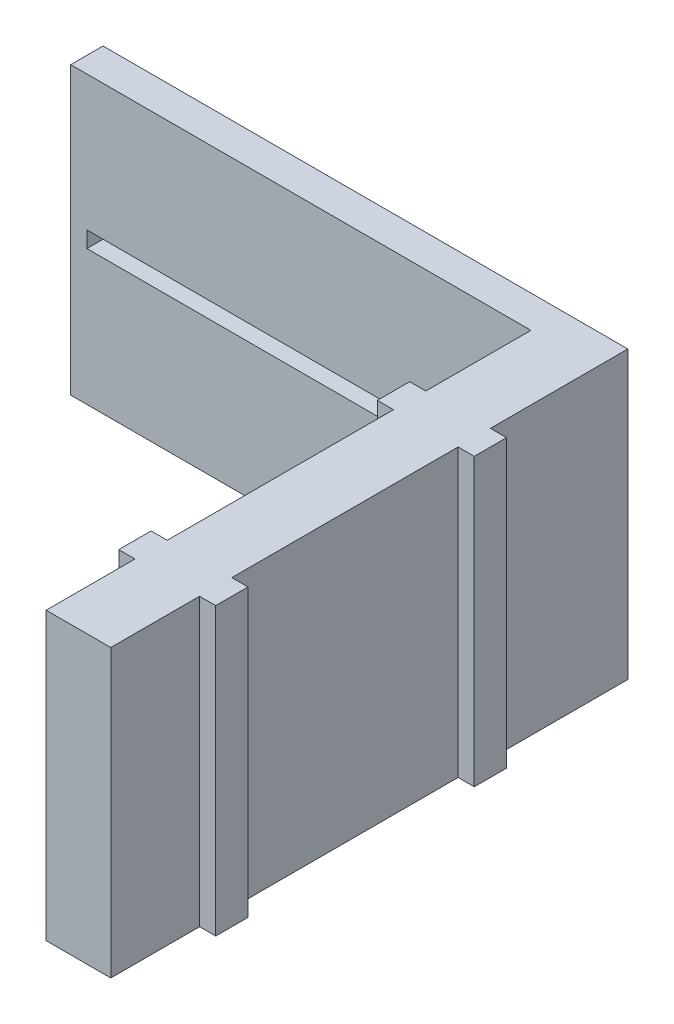
ISO-10303-21;
HEADER;
FILE_DESCRIPTION(('STEP AP214'),'2;1');
FILE_NAME('part.step','',(''),(''),'','','');
FILE_SCHEMA(('AUTOMOTIVE_DESIGN { 1 0 10303 214 1 1 1 1 }'));
ENDSEC;
DATA;
#1=APPLICATION_CONTEXT('core data for automotive mechanical design processes');
#2=APPLICATION_PROTOCOL_DEFINITION('international standard','automotive_design',2000,#1);
#3=PRODUCT_CONTEXT('',#1,'mechanical');
#4=PRODUCT('Part','Part','',(#3));
#5=PRODUCT_RELATED_PRODUCT_CATEGORY('part','',(#4));
#6=PRODUCT_DEFINITION_FORMATION('','',#4);
#7=PRODUCT_DEFINITION_CONTEXT('part definition',#1,'design');
#8=PRODUCT_DEFINITION('design','',#6,#7);
#9=PRODUCT_DEFINITION_SHAPE('','',#8);
#10=(LENGTH_UNIT() NAMED_UNIT(*) SI_UNIT(.MILLI.,.METRE.));
#11=(NAMED_UNIT(*) PLANE_ANGLE_UNIT() SI_UNIT($,.RADIAN.));
#12=(NAMED_UNIT(*) SI_UNIT($,.STERADIAN.) SOLID_ANGLE_UNIT());
#13=UNCERTAINTY_MEASURE_WITH_UNIT(LENGTH_MEASURE(1.E-05),#10,'distance_accuracy_value','');
#14=(GEOMETRIC_REPRESENTATION_CONTEXT(3) GLOBAL_UNCERTAINTY_ASSIGNED_CONTEXT((#13)) GLOBAL_UNIT_ASSIGNED_CONTEXT((#10,
#11,#12)) REPRESENTATION_CONTEXT('',''));
#15=CARTESIAN_POINT('',(0.,0.,0.));
#16=DIRECTION('',(0.,0.,1.));
#17=DIRECTION('',(1.,0.,0.));
#18=AXIS2_PLACEMENT_3D('',#15,#16,#17);
#19=CARTESIAN_POINT('',(-10.,0.,0.));
#20=DIRECTION('',(-1.,0.,0.));
#21=DIRECTION('',(0.,0.,-1.));
#22=AXIS2_PLACEMENT_3D('',#19,#20,#21);
#23=PLANE('',#22);
#24=DIRECTION('',(0.,0.,1.));
#25=VECTOR('',#24,1.);
#26=CARTESIAN_POINT('',(-10.,44.2846165618336,80.));
#27=LINE('',#26,#25);
#28=CARTESIAN_POINT('',(-10.,44.2846165618336,-27.47));
#29=VERTEX_POINT('',#28);
#30=CARTESIAN_POINT('',(-10.,44.2846165618336,42.53));
#31=VERTEX_POINT('',#30);
#32=EDGE_CURVE('E292',#29,#31,#27,.T.);
#33=ORIENTED_EDGE('',*,*,#32,.F.);
#34=DIRECTION('',(0.,1.,0.));
#35=VECTOR('',#34,1.);
#36=CARTESIAN_POINT('',(-10.,0.,-27.47));
#37=LINE('',#36,#35);
#38=CARTESIAN_POINT('',(-10.,-44.2846165618336,-27.47));
#39=VERTEX_POINT('',#38);
#40=EDGE_CURVE('E230',#39,#29,#37,.T.);
#41=ORIENTED_EDGE('',*,*,#40,.F.);
#42=DIRECTION('',(0.,0.,-1.));
#43=VECTOR('',#42,1.);
#44=CARTESIAN_POINT('',(-10.,-44.2846165618336,80.));
#45=LINE('',#44,#43);
#46=CARTESIAN_POINT('',(-10.,-44.2846165618336,42.53));
#47=VERTEX_POINT('',#46);
#48=EDGE_CURVE('E285',#47,#39,#45,.T.);
#49=ORIENTED_EDGE('',*,*,#48,.F.);
#50=DIRECTION('',(0.,1.,0.));
#51=VECTOR('',#50,1.);
#52=CARTESIAN_POINT('',(-10.,-44.2846165618336,42.53));
#53=LINE('',#52,#51);
#54=EDGE_CURVE('E56',#47,#31,#53,.T.);
#55=ORIENTED_EDGE('',*,*,#54,.T.);
#56=EDGE_LOOP('',(#33,#41,#49,#55));
#57=FACE_BOUND('',#56,.T.);
#58=ADVANCED_FACE('F41',(#57),#23,.T.);
#59=CARTESIAN_POINT('',(-10.,-44.2846165618336,-37.47));
#60=VERTEX_POINT('',#59);
#61=CARTESIAN_POINT('',(-10.,-44.2846165618336,-70.));
#62=VERTEX_POINT('',#61);
#63=EDGE_CURVE('E280',#60,#62,#45,.T.);
#64=ORIENTED_EDGE('',*,*,#63,.F.);
#65=DIRECTION('',(0.,-1.,0.));
#66=VECTOR('',#65,1.);
#67=CARTESIAN_POINT('',(-10.,0.,-37.47));
#68=LINE('',#67,#66);
#69=CARTESIAN_POINT('',(-10.,44.2846165618336,-37.47));
#70=VERTEX_POINT('',#69);
#71=EDGE_CURVE('E64',#70,#60,#68,.T.);
#72=ORIENTED_EDGE('',*,*,#71,.F.);
#73=CARTESIAN_POINT('',(-10.,44.2846165618336,-70.));
#74=VERTEX_POINT('',#73);
#75=EDGE_CURVE('E289',#74,#70,#27,.T.);
#76=ORIENTED_EDGE('',*,*,#75,.F.);
#77=DIRECTION('',(0.,1.,0.));
#78=VECTOR('',#77,1.);
#79=CARTESIAN_POINT('',(-10.,44.2846165618336,-70.));
#80=LINE('',#79,#78);
#81=CARTESIAN_POINT('',(-10.,2.49999999999999,-70.));
#82=VERTEX_POINT('',#81);
#83=EDGE_CURVE('E291',#82,#74,#80,.T.);
#84=ORIENTED_EDGE('',*,*,#83,.F.);
#85=DIRECTION('',(0.,0.,1.));
#86=VECTOR('',#85,1.);
#87=CARTESIAN_POINT('',(-10.,2.49999999999999,-80.));
#88=LINE('',#87,#86);
#89=CARTESIAN_POINT('',(-10.,2.50000000000001,-80.));
#90=VERTEX_POINT('',#89);
#91=EDGE_CURVE('E11',#90,#82,#88,.T.);
#92=ORIENTED_EDGE('',*,*,#91,.F.);
#93=DIRECTION('',(0.,1.,0.));
#94=VECTOR('',#93,1.);
#95=CARTESIAN_POINT('',(-10.,44.2846165618336,-80.));
#96=LINE('',#95,#94);
#97=CARTESIAN_POINT('',(-10.,-2.5,-80.));
#98=VERTEX_POINT('',#97);
#99=EDGE_CURVE('E232',#98,#90,#96,.T.);
#100=ORIENTED_EDGE('',*,*,#99,.F.);
#101=DIRECTION('',(0.,0.,-1.));
#102=VECTOR('',#101,1.);
#103=CARTESIAN_POINT('',(-10.,-2.50000000000001,-80.));
#104=LINE('',#103,#102);
#105=CARTESIAN_POINT('',(-10.,-2.50000000000001,-70.));
#106=VERTEX_POINT('',#105);
#107=EDGE_CURVE('E295',#106,#98,#104,.T.);
#108=ORIENTED_EDGE('',*,*,#107,.F.);
#109=EDGE_CURVE('E296',#62,#106,#80,.T.);
#110=ORIENTED_EDGE('',*,*,#109,.F.);
#111=EDGE_LOOP('',(#64,#72,#76,#84,#92,#100,#108,#110));
#112=FACE_BOUND('',#111,.T.);
#113=ADVANCED_FACE('F422',(#112),#23,.T.);
#114=CARTESIAN_POINT('',(10.,0.,0.));
#115=DIRECTION('',(1.,0.,0.));
#116=DIRECTION('',(0.,0.,-1.));
#117=AXIS2_PLACEMENT_3D('',#114,#115,#116);
#118=PLANE('',#117);
#119=DIRECTION('',(0.,0.,-1.));
#120=VECTOR('',#119,1.);
#121=CARTESIAN_POINT('',(10.,-44.2846165618336,80.));
#122=LINE('',#121,#120);
#123=CARTESIAN_POINT('',(10.,-44.2846165618336,42.53));
#124=VERTEX_POINT('',#123);
#125=CARTESIAN_POINT('',(10.,-44.2846165618336,-27.47));
#126=VERTEX_POINT('',#125);
#127=EDGE_CURVE('E399',#124,#126,#122,.T.);
#128=ORIENTED_EDGE('',*,*,#127,.T.);
#129=DIRECTION('',(0.,1.,0.));
#130=VECTOR('',#129,1.);
#131=CARTESIAN_POINT('',(10.,0.,-27.47));
#132=LINE('',#131,#130);
#133=CARTESIAN_POINT('',(10.,44.2846165618336,-27.47));
#134=VERTEX_POINT('',#133);
#135=EDGE_CURVE('E311',#126,#134,#132,.T.);
#136=ORIENTED_EDGE('',*,*,#135,.T.);
#137=DIRECTION('',(0.,0.,1.));
#138=VECTOR('',#137,1.);
#139=CARTESIAN_POINT('',(10.,44.2846165618336,80.));
#140=LINE('',#139,#138);
#141=CARTESIAN_POINT('',(10.,44.2846165618336,42.53));
#142=VERTEX_POINT('',#141);
#143=EDGE_CURVE('E393',#134,#142,#140,.T.);
#144=ORIENTED_EDGE('',*,*,#143,.T.);
#145=DIRECTION('',(0.,1.,0.));
#146=VECTOR('',#145,1.);
#147=CARTESIAN_POINT('',(10.,-44.2846165618336,42.53));
#148=LINE('',#147,#146);
#149=EDGE_CURVE('E338',#124,#142,#148,.T.);
#150=ORIENTED_EDGE('',*,*,#149,.F.);
#151=EDGE_LOOP('',(#128,#136,#144,#150));
#152=FACE_BOUND('',#151,.T.);
#153=ADVANCED_FACE('F464',(#152),#118,.T.);
#154=CARTESIAN_POINT('',(10.,44.2846165618336,-80.));
#155=VERTEX_POINT('',#154);
#156=CARTESIAN_POINT('',(10.,44.2846165618336,-37.47));
#157=VERTEX_POINT('',#156);
#158=EDGE_CURVE('E389',#155,#157,#140,.T.);
#159=ORIENTED_EDGE('',*,*,#158,.T.);
#160=DIRECTION('',(0.,-1.,0.));
#161=VECTOR('',#160,1.);
#162=CARTESIAN_POINT('',(10.,0.,-37.47));
#163=LINE('',#162,#161);
#164=CARTESIAN_POINT('',(10.,-44.2846165618336,-37.47));
#165=VERTEX_POINT('',#164);
#166=EDGE_CURVE('E303',#157,#165,#163,.T.);
#167=ORIENTED_EDGE('',*,*,#166,.T.);
#168=CARTESIAN_POINT('',(10.,-44.2846165618336,-80.));
#169=VERTEX_POINT('',#168);
#170=EDGE_CURVE('E395',#165,#169,#122,.T.);
#171=ORIENTED_EDGE('',*,*,#170,.T.);
#172=DIRECTION('',(0.,1.,0.));
#173=VECTOR('',#172,1.);
#174=CARTESIAN_POINT('',(10.,44.2846165618336,-80.));
#175=LINE('',#174,#173);
#176=EDGE_CURVE('E385',#169,#155,#175,.T.);
#177=ORIENTED_EDGE('',*,*,#176,.T.);
#178=EDGE_LOOP('',(#159,#167,#171,#177));
#179=FACE_BOUND('',#178,.T.);
#180=ADVANCED_FACE('F508',(#179),#118,.T.);
#181=CARTESIAN_POINT('',(10.,44.2846165618336,-80.));
#182=DIRECTION('',(0.,0.,1.));
#183=DIRECTION('',(1.,0.,0.));
#184=AXIS2_PLACEMENT_3D('',#181,#182,#183);
#185=PLANE('',#184);
#186=ORIENTED_EDGE('',*,*,#99,.T.);
#187=DIRECTION('',(-1.,0.,0.));
#188=VECTOR('',#187,1.);
#189=CARTESIAN_POINT('',(0.,2.49999999999999,-80.));
#190=LINE('',#189,#188);
#191=CARTESIAN_POINT('',(-147.4,2.49999999999999,-80.));
#192=VERTEX_POINT('',#191);
#193=EDGE_CURVE('E368',#90,#192,#190,.T.);
#194=ORIENTED_EDGE('',*,*,#193,.T.);
#195=DIRECTION('',(0.,1.,0.));
#196=VECTOR('',#195,1.);
#197=CARTESIAN_POINT('',(-147.4,-2.50000000000001,-80.));
#198=LINE('',#197,#196);
#199=CARTESIAN_POINT('',(-147.4,-2.50000000000001,-80.));
#200=VERTEX_POINT('',#199);
#201=EDGE_CURVE('E324',#200,#192,#198,.T.);
#202=ORIENTED_EDGE('',*,*,#201,.F.);
#203=DIRECTION('',(-1.,0.,0.));
#204=VECTOR('',#203,1.);
#205=CARTESIAN_POINT('',(0.,-2.50000000000001,-80.));
#206=LINE('',#205,#204);
#207=EDGE_CURVE('E366',#98,#200,#206,.T.);
#208=ORIENTED_EDGE('',*,*,#207,.F.);
#209=EDGE_LOOP('',(#186,#194,#202,#208));
#210=FACE_BOUND('',#209,.T.);
#211=DIRECTION('',(0.,-1.,0.));
#212=VECTOR('',#211,1.);
#213=CARTESIAN_POINT('',(-152.4,-44.2846165618336,-80.));
#214=LINE('',#213,#212);
#215=CARTESIAN_POINT('',(-152.4,44.2846165618336,-80.));
#216=VERTEX_POINT('',#215);
#217=CARTESIAN_POINT('',(-152.4,-44.2846165618336,-80.));
#218=VERTEX_POINT('',#217);
#219=EDGE_CURVE('E373',#216,#218,#214,.T.);
#220=ORIENTED_EDGE('',*,*,#219,.F.);
#221=DIRECTION('',(-1.,0.,0.));
#222=VECTOR('',#221,1.);
#223=CARTESIAN_POINT('',(10.,44.2846165618336,-80.));
#224=LINE('',#223,#222);
#225=EDGE_CURVE('E49',#155,#216,#224,.T.);
#226=ORIENTED_EDGE('',*,*,#225,.F.);
#227=ORIENTED_EDGE('',*,*,#176,.F.);
#228=DIRECTION('',(-1.,0.,0.));
#229=VECTOR('',#228,1.);
#230=CARTESIAN_POINT('',(10.,-44.2846165618336,-80.));
#231=LINE('',#230,#229);
#232=EDGE_CURVE('E398',#169,#218,#231,.T.);
#233=ORIENTED_EDGE('',*,*,#232,.T.);
#234=EDGE_LOOP('',(#220,#226,#227,#233));
#235=FACE_BOUND('',#234,.T.);
#236=ADVANCED_FACE('F43',(#210,#235),#185,.F.);
#237=CARTESIAN_POINT('',(10.,44.2846165618336,80.));
#238=DIRECTION('',(0.,-1.,0.));
#239=DIRECTION('',(0.,0.,-1.));
#240=AXIS2_PLACEMENT_3D('',#237,#238,#239);
#241=PLANE('',#240);
#242=DIRECTION('',(1.,0.,0.));
#243=VECTOR('',#242,1.);
#244=CARTESIAN_POINT('',(-152.4,44.2846165618336,-70.));
#245=LINE('',#244,#243);
#246=CARTESIAN_POINT('',(-152.4,44.2846165618336,-70.));
#247=VERTEX_POINT('',#246);
#248=EDGE_CURVE('E380',#247,#74,#245,.T.);
#249=ORIENTED_EDGE('',*,*,#248,.T.);
#250=ORIENTED_EDGE('',*,*,#75,.T.);
#251=DIRECTION('',(1.,0.,0.));
#252=VECTOR('',#251,1.);
#253=CARTESIAN_POINT('',(-15.,44.2846165618336,-37.47));
#254=LINE('',#253,#252);
#255=CARTESIAN_POINT('',(-15.,44.2846165618336,-37.47));
#256=VERTEX_POINT('',#255);
#257=EDGE_CURVE('E233',#256,#70,#254,.T.);
#258=ORIENTED_EDGE('',*,*,#257,.F.);
#259=DIRECTION('',(0.,0.,1.));
#260=VECTOR('',#259,1.);
#261=CARTESIAN_POINT('',(-15.,44.2846165618336,0.));
#262=LINE('',#261,#260);
#263=CARTESIAN_POINT('',(-15.,44.2846165618336,-27.47));
#264=VERTEX_POINT('',#263);
#265=EDGE_CURVE('E221',#256,#264,#262,.T.);
#266=ORIENTED_EDGE('',*,*,#265,.T.);
#267=DIRECTION('',(1.,0.,0.));
#268=VECTOR('',#267,1.);
#269=CARTESIAN_POINT('',(-15.,44.2846165618336,-27.47));
#270=LINE('',#269,#268);
#271=EDGE_CURVE('E227',#264,#29,#270,.T.);
#272=ORIENTED_EDGE('',*,*,#271,.T.);
#273=ORIENTED_EDGE('',*,*,#32,.T.);
#274=DIRECTION('',(1.,0.,0.));
#275=VECTOR('',#274,1.);
#276=CARTESIAN_POINT('',(-15.,44.2846165618336,42.53));
#277=LINE('',#276,#275);
#278=CARTESIAN_POINT('',(-15.,44.2846165618336,42.53));
#279=VERTEX_POINT('',#278);
#280=EDGE_CURVE('E246',#279,#31,#277,.T.);
#281=ORIENTED_EDGE('',*,*,#280,.F.);
#282=DIRECTION('',(0.,0.,1.));
#283=VECTOR('',#282,1.);
#284=CARTESIAN_POINT('',(-15.,44.2846165618336,42.53));
#285=LINE('',#284,#283);
#286=CARTESIAN_POINT('',(-15.,44.2846165618336,52.53));
#287=VERTEX_POINT('',#286);
#288=EDGE_CURVE('E252',#279,#287,#285,.T.);
#289=ORIENTED_EDGE('',*,*,#288,.T.);
#290=DIRECTION('',(1.,0.,0.));
#291=VECTOR('',#290,1.);
#292=CARTESIAN_POINT('',(-15.,44.2846165618336,52.53));
#293=LINE('',#292,#291);
#294=CARTESIAN_POINT('',(-10.,44.2846165618336,52.53));
#295=VERTEX_POINT('',#294);
#296=EDGE_CURVE('E265',#287,#295,#293,.T.);
#297=ORIENTED_EDGE('',*,*,#296,.T.);
#298=CARTESIAN_POINT('',(-10.,44.2846165618336,80.));
#299=VERTEX_POINT('',#298);
#300=EDGE_CURVE('E288',#295,#299,#27,.T.);
#301=ORIENTED_EDGE('',*,*,#300,.T.);
#302=DIRECTION('',(-1.,0.,0.));
#303=VECTOR('',#302,1.);
#304=CARTESIAN_POINT('',(10.,44.2846165618336,80.));
#305=LINE('',#304,#303);
#306=CARTESIAN_POINT('',(10.,44.2846165618336,80.));
#307=VERTEX_POINT('',#306);
#308=EDGE_CURVE('E403',#307,#299,#305,.T.);
#309=ORIENTED_EDGE('',*,*,#308,.F.);
#310=CARTESIAN_POINT('',(10.,44.2846165618336,52.53));
#311=VERTEX_POINT('',#310);
#312=EDGE_CURVE('E388',#311,#307,#140,.T.);
#313=ORIENTED_EDGE('',*,*,#312,.F.);
#314=DIRECTION('',(-1.,0.,0.));
#315=VECTOR('',#314,1.);
#316=CARTESIAN_POINT('',(15.,44.2846165618336,52.53));
#317=LINE('',#316,#315);
#318=CARTESIAN_POINT('',(15.,44.2846165618336,52.53));
#319=VERTEX_POINT('',#318);
#320=EDGE_CURVE('E325',#319,#311,#317,.T.);
#321=ORIENTED_EDGE('',*,*,#320,.F.);
#322=DIRECTION('',(0.,0.,1.));
#323=VECTOR('',#322,1.);
#324=CARTESIAN_POINT('',(15.,44.2846165618336,42.53));
#325=LINE('',#324,#323);
#326=CARTESIAN_POINT('',(15.,44.2846165618336,42.53));
#327=VERTEX_POINT('',#326);
#328=EDGE_CURVE('E341',#327,#319,#325,.T.);
#329=ORIENTED_EDGE('',*,*,#328,.F.);
#330=DIRECTION('',(-1.,0.,0.));
#331=VECTOR('',#330,1.);
#332=CARTESIAN_POINT('',(15.,44.2846165618336,42.53));
#333=LINE('',#332,#331);
#334=EDGE_CURVE('E334',#327,#142,#333,.T.);
#335=ORIENTED_EDGE('',*,*,#334,.T.);
#336=ORIENTED_EDGE('',*,*,#143,.F.);
#337=DIRECTION('',(-1.,0.,0.));
#338=VECTOR('',#337,1.);
#339=CARTESIAN_POINT('',(15.,44.2846165618336,-27.47));
#340=LINE('',#339,#338);
#341=CARTESIAN_POINT('',(15.,44.2846165618336,-27.47));
#342=VERTEX_POINT('',#341);
#343=EDGE_CURVE('E310',#342,#134,#340,.T.);
#344=ORIENTED_EDGE('',*,*,#343,.F.);
#345=DIRECTION('',(0.,0.,1.));
#346=VECTOR('',#345,1.);
#347=CARTESIAN_POINT('',(15.,44.2846165618336,0.));
#348=LINE('',#347,#346);
#349=CARTESIAN_POINT('',(15.,44.2846165618336,-37.47));
#350=VERTEX_POINT('',#349);
#351=EDGE_CURVE('E308',#350,#342,#348,.T.);
#352=ORIENTED_EDGE('',*,*,#351,.F.);
#353=DIRECTION('',(-1.,0.,0.));
#354=VECTOR('',#353,1.);
#355=CARTESIAN_POINT('',(15.,44.2846165618336,-37.47));
#356=LINE('',#355,#354);
#357=EDGE_CURVE('E318',#350,#157,#356,.T.);
#358=ORIENTED_EDGE('',*,*,#357,.T.);
#359=ORIENTED_EDGE('',*,*,#158,.F.);
#360=ORIENTED_EDGE('',*,*,#225,.T.);
#361=DIRECTION('',(0.,0.,-1.));
#362=VECTOR('',#361,1.);
#363=CARTESIAN_POINT('',(-152.4,44.2846165618336,-80.));
#364=LINE('',#363,#362);
#365=EDGE_CURVE('E365',#247,#216,#364,.T.);
#366=ORIENTED_EDGE('',*,*,#365,.F.);
#367=EDGE_LOOP('',(#249,#250,#258,#266,#272,#273,#281,#289,#297,#301,#309,#313,#321,#329,#335,
#336,#344,#352,#358,#359,#360,#366));
#368=FACE_BOUND('',#367,.T.);
#369=ADVANCED_FACE('F236',(#368),#241,.F.);
#370=CARTESIAN_POINT('',(10.,44.2846165618336,80.));
#371=DIRECTION('',(0.,0.,-1.));
#372=DIRECTION('',(0.,1.,0.));
#373=AXIS2_PLACEMENT_3D('',#370,#371,#372);
#374=PLANE('',#373);
#375=ORIENTED_EDGE('',*,*,#308,.T.);
#376=DIRECTION('',(0.,-1.,0.));
#377=VECTOR('',#376,1.);
#378=CARTESIAN_POINT('',(-10.,44.2846165618336,80.));
#379=LINE('',#378,#377);
#380=CARTESIAN_POINT('',(-10.,-44.2846165618336,80.));
#381=VERTEX_POINT('',#380);
#382=EDGE_CURVE('E284',#299,#381,#379,.T.);
#383=ORIENTED_EDGE('',*,*,#382,.T.);
#384=DIRECTION('',(-1.,0.,0.));
#385=VECTOR('',#384,1.);
#386=CARTESIAN_POINT('',(10.,-44.2846165618336,80.));
#387=LINE('',#386,#385);
#388=CARTESIAN_POINT('',(10.,-44.2846165618336,80.));
#389=VERTEX_POINT('',#388);
#390=EDGE_CURVE('E401',#389,#381,#387,.T.);
#391=ORIENTED_EDGE('',*,*,#390,.F.);
#392=DIRECTION('',(0.,-1.,0.));
#393=VECTOR('',#392,1.);
#394=CARTESIAN_POINT('',(10.,44.2846165618336,80.));
#395=LINE('',#394,#393);
#396=EDGE_CURVE('E392',#307,#389,#395,.T.);
#397=ORIENTED_EDGE('',*,*,#396,.F.);
#398=EDGE_LOOP('',(#375,#383,#391,#397));
#399=FACE_BOUND('',#398,.T.);
#400=ADVANCED_FACE('F435',(#399),#374,.F.);
#401=CARTESIAN_POINT('',(10.,-44.2846165618336,80.));
#402=DIRECTION('',(0.,1.,0.));
#403=DIRECTION('',(0.,0.,1.));
#404=AXIS2_PLACEMENT_3D('',#401,#402,#403);
#405=PLANE('',#404);
#406=DIRECTION('',(0.,0.,1.));
#407=VECTOR('',#406,1.);
#408=CARTESIAN_POINT('',(-152.4,-44.2846165618336,-70.));
#409=LINE('',#408,#407);
#410=CARTESIAN_POINT('',(-152.4,-44.2846165618336,-70.));
#411=VERTEX_POINT('',#410);
#412=EDGE_CURVE('E376',#218,#411,#409,.T.);
#413=ORIENTED_EDGE('',*,*,#412,.F.);
#414=ORIENTED_EDGE('',*,*,#232,.F.);
#415=ORIENTED_EDGE('',*,*,#170,.F.);
#416=DIRECTION('',(-1.,0.,0.));
#417=VECTOR('',#416,1.);
#418=CARTESIAN_POINT('',(15.,-44.2846165618336,-37.47));
#419=LINE('',#418,#417);
#420=CARTESIAN_POINT('',(15.,-44.2846165618336,-37.47));
#421=VERTEX_POINT('',#420);
#422=EDGE_CURVE('E320',#421,#165,#419,.T.);
#423=ORIENTED_EDGE('',*,*,#422,.F.);
#424=DIRECTION('',(0.,0.,-1.));
#425=VECTOR('',#424,1.);
#426=CARTESIAN_POINT('',(15.,-44.2846165618336,0.));
#427=LINE('',#426,#425);
#428=CARTESIAN_POINT('',(15.,-44.2846165618336,-27.47));
#429=VERTEX_POINT('',#428);
#430=EDGE_CURVE('E302',#429,#421,#427,.T.);
#431=ORIENTED_EDGE('',*,*,#430,.F.);
#432=DIRECTION('',(-1.,0.,0.));
#433=VECTOR('',#432,1.);
#434=CARTESIAN_POINT('',(15.,-44.2846165618336,-27.47));
#435=LINE('',#434,#433);
#436=EDGE_CURVE('E322',#429,#126,#435,.T.);
#437=ORIENTED_EDGE('',*,*,#436,.T.);
#438=ORIENTED_EDGE('',*,*,#127,.F.);
#439=DIRECTION('',(-1.,0.,0.));
#440=VECTOR('',#439,1.);
#441=CARTESIAN_POINT('',(15.,-44.2846165618336,42.53));
#442=LINE('',#441,#440);
#443=CARTESIAN_POINT('',(15.,-44.2846165618336,42.53));
#444=VERTEX_POINT('',#443);
#445=EDGE_CURVE('E331',#444,#124,#442,.T.);
#446=ORIENTED_EDGE('',*,*,#445,.F.);
#447=DIRECTION('',(0.,0.,-1.));
#448=VECTOR('',#447,1.);
#449=CARTESIAN_POINT('',(15.,-44.2846165618336,52.53));
#450=LINE('',#449,#448);
#451=CARTESIAN_POINT('',(15.,-44.2846165618336,52.53));
#452=VERTEX_POINT('',#451);
#453=EDGE_CURVE('E345',#452,#444,#450,.T.);
#454=ORIENTED_EDGE('',*,*,#453,.F.);
#455=DIRECTION('',(-1.,0.,0.));
#456=VECTOR('',#455,1.);
#457=CARTESIAN_POINT('',(15.,-44.2846165618336,52.53));
#458=LINE('',#457,#456);
#459=CARTESIAN_POINT('',(10.,-44.2846165618336,52.53));
#460=VERTEX_POINT('',#459);
#461=EDGE_CURVE('E328',#452,#460,#458,.T.);
#462=ORIENTED_EDGE('',*,*,#461,.T.);
#463=EDGE_CURVE('E396',#389,#460,#122,.T.);
#464=ORIENTED_EDGE('',*,*,#463,.F.);
#465=ORIENTED_EDGE('',*,*,#390,.T.);
#466=CARTESIAN_POINT('',(-10.,-44.2846165618336,52.53));
#467=VERTEX_POINT('',#466);
#468=EDGE_CURVE('E281',#381,#467,#45,.T.);
#469=ORIENTED_EDGE('',*,*,#468,.T.);
#470=DIRECTION('',(1.,0.,0.));
#471=VECTOR('',#470,1.);
#472=CARTESIAN_POINT('',(-15.,-44.2846165618336,52.53));
#473=LINE('',#472,#471);
#474=CARTESIAN_POINT('',(-15.,-44.2846165618336,52.53));
#475=VERTEX_POINT('',#474);
#476=EDGE_CURVE('E270',#475,#467,#473,.T.);
#477=ORIENTED_EDGE('',*,*,#476,.F.);
#478=DIRECTION('',(0.,0.,-1.));
#479=VECTOR('',#478,1.);
#480=CARTESIAN_POINT('',(-15.,-44.2846165618336,52.53));
#481=LINE('',#480,#479);
#482=CARTESIAN_POINT('',(-15.,-44.2846165618336,42.53));
#483=VERTEX_POINT('',#482);
#484=EDGE_CURVE('E259',#475,#483,#481,.T.);
#485=ORIENTED_EDGE('',*,*,#484,.T.);
#486=DIRECTION('',(1.,0.,0.));
#487=VECTOR('',#486,1.);
#488=CARTESIAN_POINT('',(-15.,-44.2846165618336,42.53));
#489=LINE('',#488,#487);
#490=EDGE_CURVE('E273',#483,#47,#489,.T.);
#491=ORIENTED_EDGE('',*,*,#490,.T.);
#492=ORIENTED_EDGE('',*,*,#48,.T.);
#493=DIRECTION('',(1.,0.,0.));
#494=VECTOR('',#493,1.);
#495=CARTESIAN_POINT('',(-15.,-44.2846165618336,-27.47));
#496=LINE('',#495,#494);
#497=CARTESIAN_POINT('',(-15.,-44.2846165618336,-27.47));
#498=VERTEX_POINT('',#497);
#499=EDGE_CURVE('E244',#498,#39,#496,.T.);
#500=ORIENTED_EDGE('',*,*,#499,.F.);
#501=DIRECTION('',(0.,0.,-1.));
#502=VECTOR('',#501,1.);
#503=CARTESIAN_POINT('',(-15.,-44.2846165618336,0.));
#504=LINE('',#503,#502);
#505=CARTESIAN_POINT('',(-15.,-44.2846165618336,-37.47));
#506=VERTEX_POINT('',#505);
#507=EDGE_CURVE('E223',#498,#506,#504,.T.);
#508=ORIENTED_EDGE('',*,*,#507,.T.);
#509=DIRECTION('',(1.,0.,0.));
#510=VECTOR('',#509,1.);
#511=CARTESIAN_POINT('',(-15.,-44.2846165618336,-37.47));
#512=LINE('',#511,#510);
#513=EDGE_CURVE('E249',#506,#60,#512,.T.);
#514=ORIENTED_EDGE('',*,*,#513,.T.);
#515=ORIENTED_EDGE('',*,*,#63,.T.);
#516=DIRECTION('',(1.,0.,0.));
#517=VECTOR('',#516,1.);
#518=CARTESIAN_POINT('',(-152.4,-44.2846165618336,-70.));
#519=LINE('',#518,#517);
#520=EDGE_CURVE('E382',#411,#62,#519,.T.);
#521=ORIENTED_EDGE('',*,*,#520,.F.);
#522=EDGE_LOOP('',(#413,#414,#415,#423,#431,#437,#438,#446,#454,#462,#464,#465,#469,#477,#485,
#491,#492,#500,#508,#514,#515,#521));
#523=FACE_BOUND('',#522,.T.);
#524=ADVANCED_FACE('F427',(#523),#405,.F.);
#525=DIRECTION('',(0.,-1.,0.));
#526=VECTOR('',#525,1.);
#527=CARTESIAN_POINT('',(10.,44.2846165618336,52.53));
#528=LINE('',#527,#526);
#529=EDGE_CURVE('E314',#311,#460,#528,.T.);
#530=ORIENTED_EDGE('',*,*,#529,.F.);
#531=ORIENTED_EDGE('',*,*,#312,.T.);
#532=ORIENTED_EDGE('',*,*,#396,.T.);
#533=ORIENTED_EDGE('',*,*,#463,.T.);
#534=EDGE_LOOP('',(#530,#531,#532,#533));
#535=FACE_BOUND('',#534,.T.);
#536=ADVANCED_FACE('F504',(#535),#118,.T.);
#537=CARTESIAN_POINT('',(-152.4,44.2846165618336,-70.));
#538=DIRECTION('',(0.,0.,-1.));
#539=DIRECTION('',(-1.,0.,0.));
#540=AXIS2_PLACEMENT_3D('',#537,#538,#539);
#541=PLANE('',#540);
#542=ORIENTED_EDGE('',*,*,#520,.T.);
#543=ORIENTED_EDGE('',*,*,#109,.T.);
#544=DIRECTION('',(-1.,0.,0.));
#545=VECTOR('',#544,1.);
#546=CARTESIAN_POINT('',(0.,-2.50000000000001,-70.));
#547=LINE('',#546,#545);
#548=CARTESIAN_POINT('',(-147.4,-2.50000000000001,-70.));
#549=VERTEX_POINT('',#548);
#550=EDGE_CURVE('E363',#106,#549,#547,.T.);
#551=ORIENTED_EDGE('',*,*,#550,.T.);
#552=DIRECTION('',(0.,1.,0.));
#553=VECTOR('',#552,1.);
#554=CARTESIAN_POINT('',(-147.4,-2.50000000000001,-70.));
#555=LINE('',#554,#553);
#556=CARTESIAN_POINT('',(-147.4,2.49999999999999,-70.));
#557=VERTEX_POINT('',#556);
#558=EDGE_CURVE('E356',#549,#557,#555,.T.);
#559=ORIENTED_EDGE('',*,*,#558,.T.);
#560=DIRECTION('',(-1.,0.,0.));
#561=VECTOR('',#560,1.);
#562=CARTESIAN_POINT('',(0.,2.49999999999999,-70.));
#563=LINE('',#562,#561);
#564=EDGE_CURVE('E362',#82,#557,#563,.T.);
#565=ORIENTED_EDGE('',*,*,#564,.F.);
#566=ORIENTED_EDGE('',*,*,#83,.T.);
#567=ORIENTED_EDGE('',*,*,#248,.F.);
#568=DIRECTION('',(0.,1.,0.));
#569=VECTOR('',#568,1.);
#570=CARTESIAN_POINT('',(-152.4,44.2846165618336,-70.));
#571=LINE('',#570,#569);
#572=EDGE_CURVE('E378',#411,#247,#571,.T.);
#573=ORIENTED_EDGE('',*,*,#572,.F.);
#574=EDGE_LOOP('',(#542,#543,#551,#559,#565,#566,#567,#573));
#575=FACE_BOUND('',#574,.T.);
#576=ADVANCED_FACE('F418',(#575),#541,.F.);
#577=CARTESIAN_POINT('',(-152.4,0.,0.));
#578=DIRECTION('',(1.,0.,0.));
#579=DIRECTION('',(0.,0.,-1.));
#580=AXIS2_PLACEMENT_3D('',#577,#578,#579);
#581=PLANE('',#580);
#582=ORIENTED_EDGE('',*,*,#219,.T.);
#583=ORIENTED_EDGE('',*,*,#412,.T.);
#584=ORIENTED_EDGE('',*,*,#572,.T.);
#585=ORIENTED_EDGE('',*,*,#365,.T.);
#586=EDGE_LOOP('',(#582,#583,#584,#585));
#587=FACE_BOUND('',#586,.T.);
#588=ADVANCED_FACE('F413',(#587),#581,.F.);
#589=CARTESIAN_POINT('',(0.,-2.50000000000001,-80.));
#590=DIRECTION('',(0.,-1.,0.));
#591=DIRECTION('',(0.,0.,-1.));
#592=AXIS2_PLACEMENT_3D('',#589,#590,#591);
#593=PLANE('',#592);
#594=ORIENTED_EDGE('',*,*,#550,.F.);
#595=ORIENTED_EDGE('',*,*,#107,.T.);
#596=ORIENTED_EDGE('',*,*,#207,.T.);
#597=DIRECTION('',(0.,0.,1.));
#598=VECTOR('',#597,1.);
#599=CARTESIAN_POINT('',(-147.4,-2.50000000000001,-80.));
#600=LINE('',#599,#598);
#601=EDGE_CURVE('E359',#200,#549,#600,.T.);
#602=ORIENTED_EDGE('',*,*,#601,.T.);
#603=EDGE_LOOP('',(#594,#595,#596,#602));
#604=FACE_BOUND('',#603,.T.);
#605=ADVANCED_FACE('F493',(#604),#593,.F.);
#606=CARTESIAN_POINT('',(0.,2.49999999999999,-80.));
#607=DIRECTION('',(0.,1.,0.));
#608=DIRECTION('',(0.,0.,1.));
#609=AXIS2_PLACEMENT_3D('',#606,#607,#608);
#610=PLANE('',#609);
#611=ORIENTED_EDGE('',*,*,#193,.F.);
#612=ORIENTED_EDGE('',*,*,#91,.T.);
#613=ORIENTED_EDGE('',*,*,#564,.T.);
#614=DIRECTION('',(0.,0.,1.));
#615=VECTOR('',#614,1.);
#616=CARTESIAN_POINT('',(-147.4,2.49999999999999,-80.));
#617=LINE('',#616,#615);
#618=EDGE_CURVE('E353',#192,#557,#617,.T.);
#619=ORIENTED_EDGE('',*,*,#618,.F.);
#620=EDGE_LOOP('',(#611,#612,#613,#619));
#621=FACE_BOUND('',#620,.T.);
#622=ADVANCED_FACE('F491',(#621),#610,.F.);
#623=CARTESIAN_POINT('',(-147.4,0.,0.));
#624=DIRECTION('',(1.,0.,0.));
#625=DIRECTION('',(0.,0.,-1.));
#626=AXIS2_PLACEMENT_3D('',#623,#624,#625);
#627=PLANE('',#626);
#628=ORIENTED_EDGE('',*,*,#201,.T.);
#629=ORIENTED_EDGE('',*,*,#618,.T.);
#630=ORIENTED_EDGE('',*,*,#558,.F.);
#631=ORIENTED_EDGE('',*,*,#601,.F.);
#632=EDGE_LOOP('',(#628,#629,#630,#631));
#633=FACE_BOUND('',#632,.T.);
#634=ADVANCED_FACE('F481',(#633),#627,.T.);
#635=CARTESIAN_POINT('',(15.,44.2846165618336,52.53));
#636=DIRECTION('',(0.,0.,-1.));
#637=DIRECTION('',(-1.,0.,0.));
#638=AXIS2_PLACEMENT_3D('',#635,#636,#637);
#639=PLANE('',#638);
#640=ORIENTED_EDGE('',*,*,#529,.T.);
#641=ORIENTED_EDGE('',*,*,#461,.F.);
#642=DIRECTION('',(0.,-1.,0.));
#643=VECTOR('',#642,1.);
#644=CARTESIAN_POINT('',(15.,44.2846165618336,52.53));
#645=LINE('',#644,#643);
#646=EDGE_CURVE('E347',#319,#452,#645,.T.);
#647=ORIENTED_EDGE('',*,*,#646,.F.);
#648=ORIENTED_EDGE('',*,*,#320,.T.);
#649=EDGE_LOOP('',(#640,#641,#647,#648));
#650=FACE_BOUND('',#649,.T.);
#651=ADVANCED_FACE('F477',(#650),#639,.F.);
#652=CARTESIAN_POINT('',(15.,-44.2846165618336,42.53));
#653=DIRECTION('',(0.,0.,1.));
#654=DIRECTION('',(1.,0.,0.));
#655=AXIS2_PLACEMENT_3D('',#652,#653,#654);
#656=PLANE('',#655);
#657=ORIENTED_EDGE('',*,*,#149,.T.);
#658=ORIENTED_EDGE('',*,*,#334,.F.);
#659=DIRECTION('',(0.,1.,0.));
#660=VECTOR('',#659,1.);
#661=CARTESIAN_POINT('',(15.,-44.2846165618336,42.53));
#662=LINE('',#661,#660);
#663=EDGE_CURVE('E337',#444,#327,#662,.T.);
#664=ORIENTED_EDGE('',*,*,#663,.F.);
#665=ORIENTED_EDGE('',*,*,#445,.T.);
#666=EDGE_LOOP('',(#657,#658,#664,#665));
#667=FACE_BOUND('',#666,.T.);
#668=ADVANCED_FACE('F480',(#667),#656,.F.);
#669=CARTESIAN_POINT('',(15.,0.,0.));
#670=DIRECTION('',(1.,0.,0.));
#671=DIRECTION('',(0.,0.,-1.));
#672=AXIS2_PLACEMENT_3D('',#669,#670,#671);
#673=PLANE('',#672);
#674=ORIENTED_EDGE('',*,*,#328,.T.);
#675=ORIENTED_EDGE('',*,*,#646,.T.);
#676=ORIENTED_EDGE('',*,*,#453,.T.);
#677=ORIENTED_EDGE('',*,*,#663,.T.);
#678=EDGE_LOOP('',(#674,#675,#676,#677));
#679=FACE_BOUND('',#678,.T.);
#680=ADVANCED_FACE('F475',(#679),#673,.T.);
#681=CARTESIAN_POINT('',(15.,0.,-27.47));
#682=DIRECTION('',(0.,0.,1.));
#683=DIRECTION('',(1.,0.,0.));
#684=AXIS2_PLACEMENT_3D('',#681,#682,#683);
#685=PLANE('',#684);
#686=ORIENTED_EDGE('',*,*,#135,.F.);
#687=ORIENTED_EDGE('',*,*,#436,.F.);
#688=DIRECTION('',(0.,1.,0.));
#689=VECTOR('',#688,1.);
#690=CARTESIAN_POINT('',(15.,0.,-27.47));
#691=LINE('',#690,#689);
#692=EDGE_CURVE('E299',#429,#342,#691,.T.);
#693=ORIENTED_EDGE('',*,*,#692,.T.);
#694=ORIENTED_EDGE('',*,*,#343,.T.);
#695=EDGE_LOOP('',(#686,#687,#693,#694));
#696=FACE_BOUND('',#695,.T.);
#697=ADVANCED_FACE('F471',(#696),#685,.T.);
#698=CARTESIAN_POINT('',(15.,0.,-37.47));
#699=DIRECTION('',(0.,0.,-1.));
#700=DIRECTION('',(-1.,0.,0.));
#701=AXIS2_PLACEMENT_3D('',#698,#699,#700);
#702=PLANE('',#701);
#703=ORIENTED_EDGE('',*,*,#166,.F.);
#704=ORIENTED_EDGE('',*,*,#357,.F.);
#705=DIRECTION('',(0.,-1.,0.));
#706=VECTOR('',#705,1.);
#707=CARTESIAN_POINT('',(15.,0.,-37.47));
#708=LINE('',#707,#706);
#709=EDGE_CURVE('E305',#350,#421,#708,.T.);
#710=ORIENTED_EDGE('',*,*,#709,.T.);
#711=ORIENTED_EDGE('',*,*,#422,.T.);
#712=EDGE_LOOP('',(#703,#704,#710,#711));
#713=FACE_BOUND('',#712,.T.);
#714=ADVANCED_FACE('F467',(#713),#702,.T.);
#715=CARTESIAN_POINT('',(15.,0.,0.));
#716=DIRECTION('',(1.,0.,0.));
#717=DIRECTION('',(0.,0.,-1.));
#718=AXIS2_PLACEMENT_3D('',#715,#716,#717);
#719=PLANE('',#718);
#720=ORIENTED_EDGE('',*,*,#692,.F.);
#721=ORIENTED_EDGE('',*,*,#430,.T.);
#722=ORIENTED_EDGE('',*,*,#709,.F.);
#723=ORIENTED_EDGE('',*,*,#351,.T.);
#724=EDGE_LOOP('',(#720,#721,#722,#723));
#725=FACE_BOUND('',#724,.T.);
#726=ADVANCED_FACE('F457',(#725),#719,.T.);
#727=DIRECTION('',(0.,-1.,0.));
#728=VECTOR('',#727,1.);
#729=CARTESIAN_POINT('',(-10.,44.2846165618336,52.53));
#730=LINE('',#729,#728);
#731=EDGE_CURVE('E256',#295,#467,#730,.T.);
#732=ORIENTED_EDGE('',*,*,#731,.T.);
#733=ORIENTED_EDGE('',*,*,#468,.F.);
#734=ORIENTED_EDGE('',*,*,#382,.F.);
#735=ORIENTED_EDGE('',*,*,#300,.F.);
#736=EDGE_LOOP('',(#732,#733,#734,#735));
#737=FACE_BOUND('',#736,.T.);
#738=ADVANCED_FACE('F438',(#737),#23,.T.);
#739=CARTESIAN_POINT('',(-15.,-44.2846165618336,42.53));
#740=DIRECTION('',(0.,0.,-1.));
#741=DIRECTION('',(-1.,0.,0.));
#742=AXIS2_PLACEMENT_3D('',#739,#740,#741);
#743=PLANE('',#742);
#744=ORIENTED_EDGE('',*,*,#54,.F.);
#745=ORIENTED_EDGE('',*,*,#490,.F.);
#746=DIRECTION('',(0.,1.,0.));
#747=VECTOR('',#746,1.);
#748=CARTESIAN_POINT('',(-15.,-44.2846165618336,42.53));
#749=LINE('',#748,#747);
#750=EDGE_CURVE('E255',#483,#279,#749,.T.);
#751=ORIENTED_EDGE('',*,*,#750,.T.);
#752=ORIENTED_EDGE('',*,*,#280,.T.);
#753=EDGE_LOOP('',(#744,#745,#751,#752));
#754=FACE_BOUND('',#753,.T.);
#755=ADVANCED_FACE('F449',(#754),#743,.T.);
#756=CARTESIAN_POINT('',(-15.,44.2846165618336,52.53));
#757=DIRECTION('',(0.,0.,1.));
#758=DIRECTION('',(1.,0.,0.));
#759=AXIS2_PLACEMENT_3D('',#756,#757,#758);
#760=PLANE('',#759);
#761=ORIENTED_EDGE('',*,*,#731,.F.);
#762=ORIENTED_EDGE('',*,*,#296,.F.);
#763=DIRECTION('',(0.,-1.,0.));
#764=VECTOR('',#763,1.);
#765=CARTESIAN_POINT('',(-15.,44.2846165618336,52.53));
#766=LINE('',#765,#764);
#767=EDGE_CURVE('E262',#287,#475,#766,.T.);
#768=ORIENTED_EDGE('',*,*,#767,.T.);
#769=ORIENTED_EDGE('',*,*,#476,.T.);
#770=EDGE_LOOP('',(#761,#762,#768,#769));
#771=FACE_BOUND('',#770,.T.);
#772=ADVANCED_FACE('F442',(#771),#760,.T.);
#773=CARTESIAN_POINT('',(-15.,0.,0.));
#774=DIRECTION('',(-1.,0.,0.));
#775=DIRECTION('',(0.,0.,-1.));
#776=AXIS2_PLACEMENT_3D('',#773,#774,#775);
#777=PLANE('',#776);
#778=ORIENTED_EDGE('',*,*,#288,.F.);
#779=ORIENTED_EDGE('',*,*,#750,.F.);
#780=ORIENTED_EDGE('',*,*,#484,.F.);
#781=ORIENTED_EDGE('',*,*,#767,.F.);
#782=EDGE_LOOP('',(#778,#779,#780,#781));
#783=FACE_BOUND('',#782,.T.);
#784=ADVANCED_FACE('F446',(#783),#777,.T.);
#785=CARTESIAN_POINT('',(-15.,0.,-27.47));
#786=DIRECTION('',(0.,0.,-1.));
#787=DIRECTION('',(-1.,0.,0.));
#788=AXIS2_PLACEMENT_3D('',#785,#786,#787);
#789=PLANE('',#788);
#790=ORIENTED_EDGE('',*,*,#40,.T.);
#791=ORIENTED_EDGE('',*,*,#271,.F.);
#792=DIRECTION('',(0.,1.,0.));
#793=VECTOR('',#792,1.);
#794=CARTESIAN_POINT('',(-15.,0.,-27.47));
#795=LINE('',#794,#793);
#796=EDGE_CURVE('E217',#498,#264,#795,.T.);
#797=ORIENTED_EDGE('',*,*,#796,.F.);
#798=ORIENTED_EDGE('',*,*,#499,.T.);
#799=EDGE_LOOP('',(#790,#791,#797,#798));
#800=FACE_BOUND('',#799,.T.);
#801=ADVANCED_FACE('F228',(#800),#789,.F.);
#802=CARTESIAN_POINT('',(-15.,0.,-37.47));
#803=DIRECTION('',(0.,0.,1.));
#804=DIRECTION('',(1.,0.,0.));
#805=AXIS2_PLACEMENT_3D('',#802,#803,#804);
#806=PLANE('',#805);
#807=ORIENTED_EDGE('',*,*,#71,.T.);
#808=ORIENTED_EDGE('',*,*,#513,.F.);
#809=DIRECTION('',(0.,-1.,0.));
#810=VECTOR('',#809,1.);
#811=CARTESIAN_POINT('',(-15.,0.,-37.47));
#812=LINE('',#811,#810);
#813=EDGE_CURVE('E239',#256,#506,#812,.T.);
#814=ORIENTED_EDGE('',*,*,#813,.F.);
#815=ORIENTED_EDGE('',*,*,#257,.T.);
#816=EDGE_LOOP('',(#807,#808,#814,#815));
#817=FACE_BOUND('',#816,.T.);
#818=ADVANCED_FACE('F677',(#817),#806,.F.);
#819=CARTESIAN_POINT('',(-15.,0.,0.));
#820=DIRECTION('',(-1.,0.,0.));
#821=DIRECTION('',(0.,0.,-1.));
#822=AXIS2_PLACEMENT_3D('',#819,#820,#821);
#823=PLANE('',#822);
#824=ORIENTED_EDGE('',*,*,#796,.T.);
#825=ORIENTED_EDGE('',*,*,#265,.F.);
#826=ORIENTED_EDGE('',*,*,#813,.T.);
#827=ORIENTED_EDGE('',*,*,#507,.F.);
#828=EDGE_LOOP('',(#824,#825,#826,#827));
#829=FACE_BOUND('',#828,.T.);
#830=ADVANCED_FACE('F219',(#829),#823,.T.);
#831=CLOSED_SHELL('',(#58,#113,#153,#180,#236,#369,#400,#524,#536,#576,#588,#605,#622,#634,#651,
#668,#680,#697,#714,#726,#738,#755,#772,#784,#801,#818,#830));
#832=MANIFOLD_SOLID_BREP('B2',#831);
#833=ADVANCED_BREP_SHAPE_REPRESENTATION('',(#18,#832),#14);
#834=SHAPE_DEFINITION_REPRESENTATION(#9,#833);
ENDSEC;
END-ISO-10303-21;
